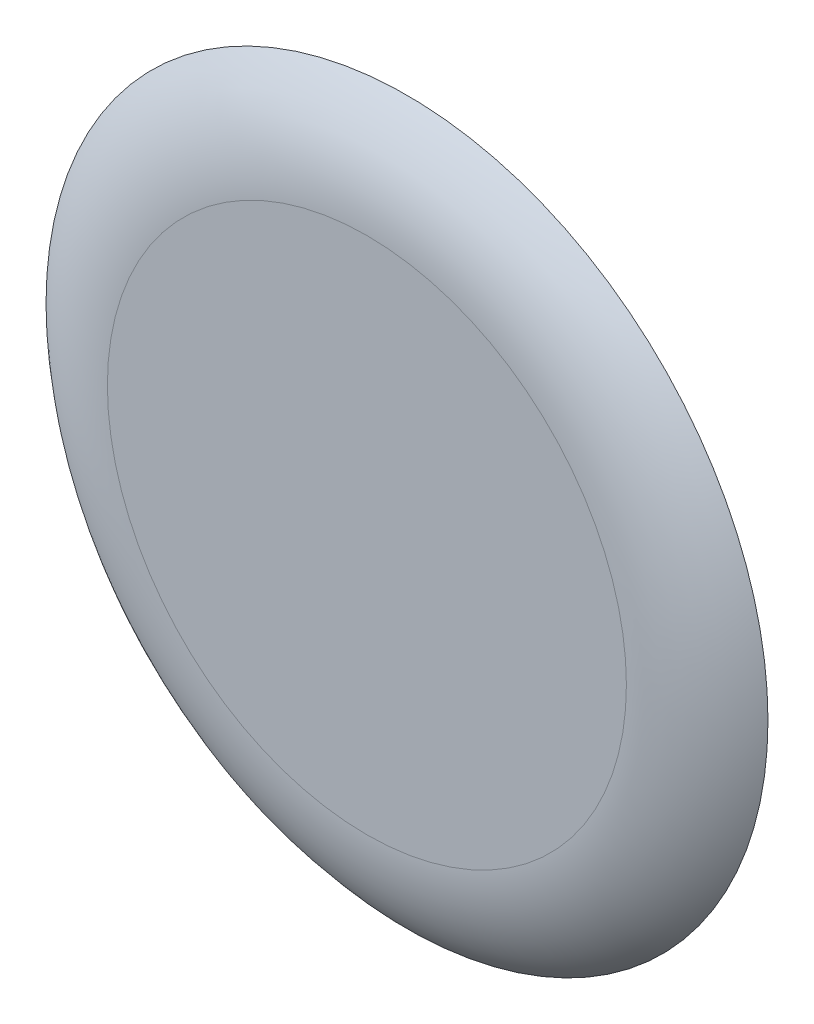
ISO-10303-21;
HEADER;
FILE_DESCRIPTION(('STEP AP214'),'2;1');
FILE_NAME('part.step','',(''),(''),'','','');
FILE_SCHEMA(('AUTOMOTIVE_DESIGN { 1 0 10303 214 1 1 1 1 }'));
ENDSEC;
DATA;
#1=APPLICATION_CONTEXT('core data for automotive mechanical design processes');
#2=APPLICATION_PROTOCOL_DEFINITION('international standard','automotive_design',2000,#1);
#3=PRODUCT_CONTEXT('',#1,'mechanical');
#4=PRODUCT('Part','Part','',(#3));
#5=PRODUCT_RELATED_PRODUCT_CATEGORY('part','',(#4));
#6=PRODUCT_DEFINITION_FORMATION('','',#4);
#7=PRODUCT_DEFINITION_CONTEXT('part definition',#1,'design');
#8=PRODUCT_DEFINITION('design','',#6,#7);
#9=PRODUCT_DEFINITION_SHAPE('','',#8);
#10=(LENGTH_UNIT() NAMED_UNIT(*) SI_UNIT(.MILLI.,.METRE.));
#11=(NAMED_UNIT(*) PLANE_ANGLE_UNIT() SI_UNIT($,.RADIAN.));
#12=(NAMED_UNIT(*) SI_UNIT($,.STERADIAN.) SOLID_ANGLE_UNIT());
#13=UNCERTAINTY_MEASURE_WITH_UNIT(LENGTH_MEASURE(1.E-05),#10,'distance_accuracy_value','');
#14=(GEOMETRIC_REPRESENTATION_CONTEXT(3) GLOBAL_UNCERTAINTY_ASSIGNED_CONTEXT((#13)) GLOBAL_UNIT_ASSIGNED_CONTEXT((#10,
#11,#12)) REPRESENTATION_CONTEXT('',''));
#15=CARTESIAN_POINT('',(0.,0.,0.));
#16=DIRECTION('',(0.,0.,1.));
#17=DIRECTION('',(1.,0.,0.));
#18=AXIS2_PLACEMENT_3D('',#15,#16,#17);
#19=CARTESIAN_POINT('',(0.,0.,0.5));
#20=DIRECTION('',(0.,0.,1.));
#21=DIRECTION('',(1.,0.,0.));
#22=AXIS2_PLACEMENT_3D('',#19,#20,#21);
#23=PLANE('',#22);
#24=CARTESIAN_POINT('',(0.,0.,0.5));
#25=DIRECTION('',(0.,0.,1.));
#26=DIRECTION('',(1.,0.,0.));
#27=AXIS2_PLACEMENT_3D('',#24,#25,#26);
#28=CIRCLE('',#27,3.23508893593265);
#29=CARTESIAN_POINT('',(3.23508893593265,0.,0.5));
#30=VERTEX_POINT('',#29);
#31=EDGE_CURVE('E10',#30,#30,#28,.T.);
#32=ORIENTED_EDGE('',*,*,#31,.T.);
#33=EDGE_LOOP('',(#32));
#34=FACE_BOUND('',#33,.T.);
#35=ADVANCED_FACE('F32',(#34),#23,.T.);
#36=CARTESIAN_POINT('',(0.,0.,0.));
#37=DIRECTION('',(0.,0.,1.));
#38=DIRECTION('',(1.,0.,0.));
#39=AXIS2_PLACEMENT_3D('',#36,#37,#38);
#40=PLANE('',#39);
#41=CARTESIAN_POINT('',(0.,0.,0.));
#42=DIRECTION('',(0.,0.,1.));
#43=DIRECTION('',(1.,0.,0.));
#44=AXIS2_PLACEMENT_3D('',#41,#42,#43);
#45=CIRCLE('',#44,4.5);
#46=CARTESIAN_POINT('',(4.5,0.,0.));
#47=VERTEX_POINT('',#46);
#48=EDGE_CURVE('E39',#47,#47,#45,.T.);
#49=ORIENTED_EDGE('',*,*,#48,.F.);
#50=EDGE_LOOP('',(#49));
#51=FACE_BOUND('',#50,.T.);
#52=ADVANCED_FACE('F47',(#51),#40,.F.);
#53=CARTESIAN_POINT('',(0.,0.,-1.35));
#54=DIRECTION('',(0.,0.,-1.));
#55=DIRECTION('',(-1.,0.,0.));
#56=AXIS2_PLACEMENT_3D('',#53,#54,#55);
#57=TOROIDAL_SURFACE('',#56,3.23508893593265,1.85);
#58=ORIENTED_EDGE('',*,*,#48,.T.);
#59=EDGE_LOOP('',(#58));
#60=FACE_BOUND('',#59,.T.);
#61=ORIENTED_EDGE('',*,*,#31,.F.);
#62=EDGE_LOOP('',(#61));
#63=FACE_BOUND('',#62,.T.);
#64=ADVANCED_FACE('F34',(#60,#63),#57,.T.);
#65=CLOSED_SHELL('',(#35,#52,#64));
#66=MANIFOLD_SOLID_BREP('B2',#65);
#67=ADVANCED_BREP_SHAPE_REPRESENTATION('',(#18,#66),#14);
#68=SHAPE_DEFINITION_REPRESENTATION(#9,#67);
ENDSEC;
END-ISO-10303-21;
